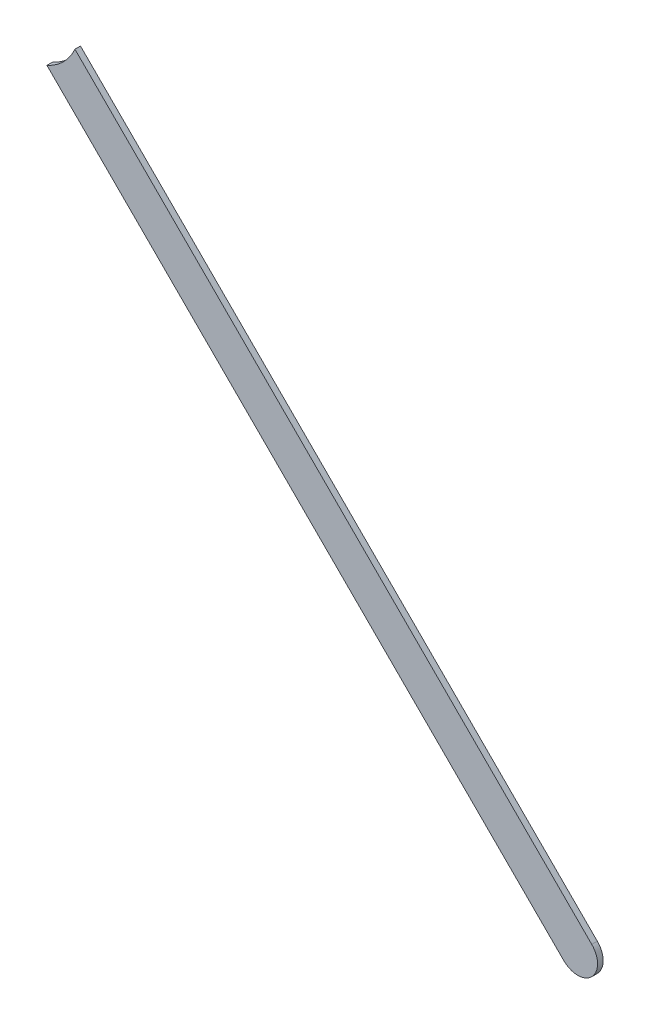
ISO-10303-21;
HEADER;
FILE_DESCRIPTION(('STEP AP214'),'2;1');
FILE_NAME('part.step','',(''),(''),'','','');
FILE_SCHEMA(('AUTOMOTIVE_DESIGN { 1 0 10303 214 1 1 1 1 }'));
ENDSEC;
DATA;
#1=APPLICATION_CONTEXT('core data for automotive mechanical design processes');
#2=APPLICATION_PROTOCOL_DEFINITION('international standard','automotive_design',2000,#1);
#3=PRODUCT_CONTEXT('',#1,'mechanical');
#4=PRODUCT('Part','Part','',(#3));
#5=PRODUCT_RELATED_PRODUCT_CATEGORY('part','',(#4));
#6=PRODUCT_DEFINITION_FORMATION('','',#4);
#7=PRODUCT_DEFINITION_CONTEXT('part definition',#1,'design');
#8=PRODUCT_DEFINITION('design','',#6,#7);
#9=PRODUCT_DEFINITION_SHAPE('','',#8);
#10=(LENGTH_UNIT() NAMED_UNIT(*) SI_UNIT(.MILLI.,.METRE.));
#11=(NAMED_UNIT(*) PLANE_ANGLE_UNIT() SI_UNIT($,.RADIAN.));
#12=(NAMED_UNIT(*) SI_UNIT($,.STERADIAN.) SOLID_ANGLE_UNIT());
#13=UNCERTAINTY_MEASURE_WITH_UNIT(LENGTH_MEASURE(1.E-05),#10,'distance_accuracy_value','');
#14=(GEOMETRIC_REPRESENTATION_CONTEXT(3) GLOBAL_UNCERTAINTY_ASSIGNED_CONTEXT((#13)) GLOBAL_UNIT_ASSIGNED_CONTEXT((#10,
#11,#12)) REPRESENTATION_CONTEXT('',''));
#15=CARTESIAN_POINT('',(0.,0.,0.));
#16=DIRECTION('',(0.,0.,1.));
#17=DIRECTION('',(1.,0.,0.));
#18=AXIS2_PLACEMENT_3D('',#15,#16,#17);
#19=CARTESIAN_POINT('',(91.8620345628035,90.2623078171966,0.));
#20=DIRECTION('',(0.707106781186549,0.707106781186546,0.));
#21=DIRECTION('',(0.707106781186546,-0.707106781186549,0.));
#22=AXIS2_PLACEMENT_3D('',#19,#20,#21);
#23=PLANE('',#22);
#24=DIRECTION('',(0.707106781186546,-0.707106781186549,0.));
#25=VECTOR('',#24,1.);
#26=CARTESIAN_POINT('',(91.62717006,90.49717232,0.03556));
#27=LINE('',#26,#25);
#28=CARTESIAN_POINT('',(91.8620345628034,90.2623078171966,0.03556));
#29=VERTEX_POINT('',#28);
#30=CARTESIAN_POINT('',(95.1772163,86.94712608,0.03556));
#31=VERTEX_POINT('',#30);
#32=EDGE_CURVE('E11',#29,#31,#27,.T.);
#33=ORIENTED_EDGE('',*,*,#32,.F.);
#34=DIRECTION('',(0.,0.,1.));
#35=VECTOR('',#34,1.);
#36=CARTESIAN_POINT('',(91.8620345628034,90.2623078171966,0.));
#37=LINE('',#36,#35);
#38=CARTESIAN_POINT('',(91.8620345628034,90.2623078171966,0.));
#39=VERTEX_POINT('',#38);
#40=EDGE_CURVE('E24',#39,#29,#37,.T.);
#41=ORIENTED_EDGE('',*,*,#40,.F.);
#42=DIRECTION('',(0.707106781186546,-0.707106781186549,0.));
#43=VECTOR('',#42,1.);
#44=CARTESIAN_POINT('',(91.62717006,90.49717232,0.));
#45=LINE('',#44,#43);
#46=CARTESIAN_POINT('',(95.1772163,86.94712608,0.));
#47=VERTEX_POINT('',#46);
#48=EDGE_CURVE('E75',#39,#47,#45,.T.);
#49=ORIENTED_EDGE('',*,*,#48,.T.);
#50=DIRECTION('',(0.,0.,1.));
#51=VECTOR('',#50,1.);
#52=CARTESIAN_POINT('',(95.1772163,86.94712608,0.));
#53=LINE('',#52,#51);
#54=EDGE_CURVE('E37',#47,#31,#53,.T.);
#55=ORIENTED_EDGE('',*,*,#54,.T.);
#56=EDGE_LOOP('',(#33,#41,#49,#55));
#57=FACE_BOUND('',#56,.T.);
#58=ADVANCED_FACE('F17',(#57),#23,.F.);
#59=CARTESIAN_POINT('',(95.267018,87.03692778,0.));
#60=DIRECTION('',(0.,0.,-1.));
#61=DIRECTION('',(-0.707106781186548,-0.707106781186548,0.));
#62=AXIS2_PLACEMENT_3D('',#59,#60,#61);
#63=CYLINDRICAL_SURFACE('',#62,0.126998782064157);
#64=CARTESIAN_POINT('',(95.267018,87.03692778,0.03556));
#65=DIRECTION('',(0.,0.,1.));
#66=DIRECTION('',(-0.707106781186548,-0.707106781186548,0.));
#67=AXIS2_PLACEMENT_3D('',#64,#65,#66);
#68=CIRCLE('',#67,0.126998782064157);
#69=CARTESIAN_POINT('',(95.3568197,87.12672948,0.03556));
#70=VERTEX_POINT('',#69);
#71=EDGE_CURVE('E83',#31,#70,#68,.T.);
#72=ORIENTED_EDGE('',*,*,#71,.F.);
#73=ORIENTED_EDGE('',*,*,#54,.F.);
#74=CARTESIAN_POINT('',(95.267018,87.03692778,0.));
#75=DIRECTION('',(0.,0.,1.));
#76=DIRECTION('',(-0.707106781186548,-0.707106781186548,0.));
#77=AXIS2_PLACEMENT_3D('',#74,#75,#76);
#78=CIRCLE('',#77,0.126998782064157);
#79=CARTESIAN_POINT('',(95.3568197,87.12672948,0.));
#80=VERTEX_POINT('',#79);
#81=EDGE_CURVE('E81',#47,#80,#78,.T.);
#82=ORIENTED_EDGE('',*,*,#81,.T.);
#83=DIRECTION('',(0.,0.,1.));
#84=VECTOR('',#83,1.);
#85=CARTESIAN_POINT('',(95.3568197,87.12672948,0.));
#86=LINE('',#85,#84);
#87=EDGE_CURVE('E67',#80,#70,#86,.T.);
#88=ORIENTED_EDGE('',*,*,#87,.T.);
#89=EDGE_LOOP('',(#72,#73,#82,#88));
#90=FACE_BOUND('',#89,.T.);
#91=ADVANCED_FACE('F89',(#90),#63,.T.);
#92=CARTESIAN_POINT('',(95.3568197,87.12672948,0.));
#93=DIRECTION('',(-0.707106781186549,-0.707106781186546,0.));
#94=DIRECTION('',(-0.707106781186546,0.707106781186549,0.));
#95=AXIS2_PLACEMENT_3D('',#92,#93,#94);
#96=PLANE('',#95);
#97=DIRECTION('',(-0.707106781186546,0.707106781186549,0.));
#98=VECTOR('',#97,1.);
#99=CARTESIAN_POINT('',(95.3568197,87.12672948,0.03556));
#100=LINE('',#99,#98);
#101=CARTESIAN_POINT('',(92.0416379628034,90.4419112171965,0.03556));
#102=VERTEX_POINT('',#101);
#103=EDGE_CURVE('E71',#70,#102,#100,.T.);
#104=ORIENTED_EDGE('',*,*,#103,.F.);
#105=ORIENTED_EDGE('',*,*,#87,.F.);
#106=DIRECTION('',(-0.707106781186546,0.707106781186549,0.));
#107=VECTOR('',#106,1.);
#108=CARTESIAN_POINT('',(95.3568197,87.12672948,0.));
#109=LINE('',#108,#107);
#110=CARTESIAN_POINT('',(92.0416379628034,90.4419112171965,0.));
#111=VERTEX_POINT('',#110);
#112=EDGE_CURVE('E63',#80,#111,#109,.T.);
#113=ORIENTED_EDGE('',*,*,#112,.T.);
#114=DIRECTION('',(0.,0.,1.));
#115=VECTOR('',#114,1.);
#116=CARTESIAN_POINT('',(92.0416379628034,90.4419112171965,0.));
#117=LINE('',#116,#115);
#118=EDGE_CURVE('E53',#111,#102,#117,.T.);
#119=ORIENTED_EDGE('',*,*,#118,.T.);
#120=EDGE_LOOP('',(#104,#105,#113,#119));
#121=FACE_BOUND('',#120,.T.);
#122=ADVANCED_FACE('F66',(#121),#96,.F.);
#123=CARTESIAN_POINT('',(91.71697176,90.58697402,0.));
#124=DIRECTION('',(0.,0.,-1.));
#125=DIRECTION('',(1.,0.,0.));
#126=AXIS2_PLACEMENT_3D('',#123,#124,#125);
#127=CYLINDRICAL_SURFACE('',#126,0.3556);
#128=ORIENTED_EDGE('',*,*,#40,.T.);
#129=CARTESIAN_POINT('',(91.71697176,90.58697402,0.03556));
#130=DIRECTION('',(0.,0.,1.));
#131=DIRECTION('',(1.,0.,0.));
#132=AXIS2_PLACEMENT_3D('',#129,#130,#131);
#133=CIRCLE('',#132,0.3556);
#134=EDGE_CURVE('E59',#29,#102,#133,.T.);
#135=ORIENTED_EDGE('',*,*,#134,.T.);
#136=ORIENTED_EDGE('',*,*,#118,.F.);
#137=CARTESIAN_POINT('',(91.71697176,90.58697402,0.));
#138=DIRECTION('',(0.,0.,1.));
#139=DIRECTION('',(1.,0.,0.));
#140=AXIS2_PLACEMENT_3D('',#137,#138,#139);
#141=CIRCLE('',#140,0.3556);
#142=EDGE_CURVE('E57',#39,#111,#141,.T.);
#143=ORIENTED_EDGE('',*,*,#142,.F.);
#144=EDGE_LOOP('',(#128,#135,#136,#143));
#145=FACE_BOUND('',#144,.T.);
#146=ADVANCED_FACE('F55',(#145),#127,.F.);
#147=CARTESIAN_POINT('',(91.62717006,90.49717232,0.));
#148=DIRECTION('',(0.,0.,-1.));
#149=DIRECTION('',(-1.,0.,0.));
#150=AXIS2_PLACEMENT_3D('',#147,#148,#149);
#151=PLANE('',#150);
#152=ORIENTED_EDGE('',*,*,#48,.F.);
#153=ORIENTED_EDGE('',*,*,#142,.T.);
#154=ORIENTED_EDGE('',*,*,#112,.F.);
#155=ORIENTED_EDGE('',*,*,#81,.F.);
#156=EDGE_LOOP('',(#152,#153,#154,#155));
#157=FACE_BOUND('',#156,.T.);
#158=ADVANCED_FACE('F74',(#157),#151,.T.);
#159=CARTESIAN_POINT('',(91.62717006,90.49717232,0.03556));
#160=DIRECTION('',(0.,0.,-1.));
#161=DIRECTION('',(-1.,0.,0.));
#162=AXIS2_PLACEMENT_3D('',#159,#160,#161);
#163=PLANE('',#162);
#164=ORIENTED_EDGE('',*,*,#134,.F.);
#165=ORIENTED_EDGE('',*,*,#32,.T.);
#166=ORIENTED_EDGE('',*,*,#71,.T.);
#167=ORIENTED_EDGE('',*,*,#103,.T.);
#168=EDGE_LOOP('',(#164,#165,#166,#167));
#169=FACE_BOUND('',#168,.T.);
#170=ADVANCED_FACE('F91',(#169),#163,.F.);
#171=CLOSED_SHELL('',(#58,#91,#122,#146,#158,#170));
#172=MANIFOLD_SOLID_BREP('B1',#171);
#173=ADVANCED_BREP_SHAPE_REPRESENTATION('',(#18,#172),#14);
#174=SHAPE_DEFINITION_REPRESENTATION(#9,#173);
ENDSEC;
END-ISO-10303-21;
